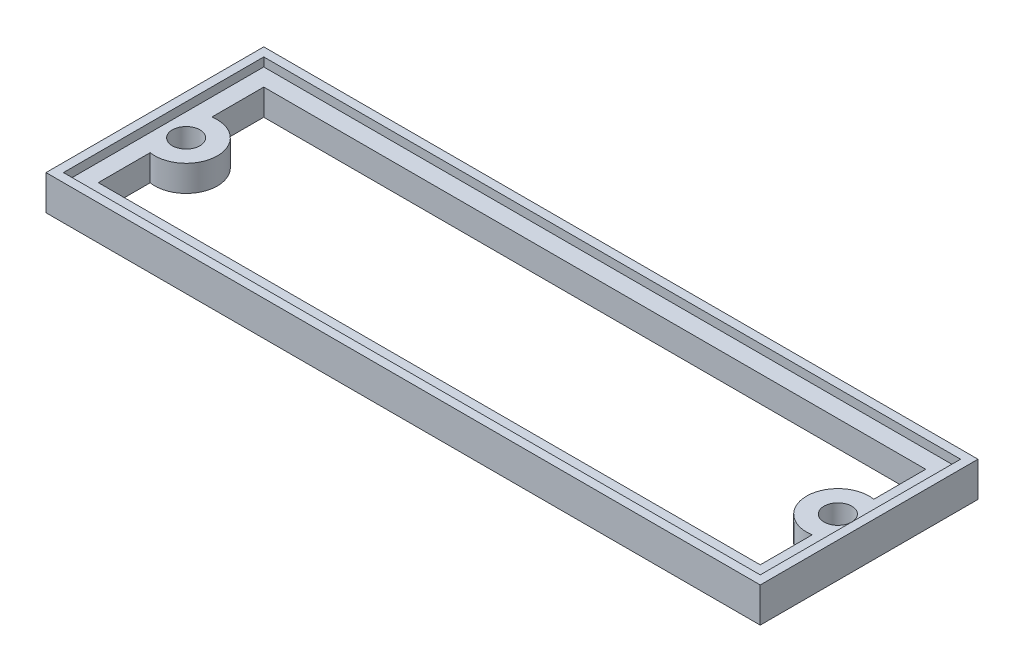
ISO-10303-21;
HEADER;
FILE_DESCRIPTION(('STEP AP214'),'2;1');
FILE_NAME('part.step','',(''),(''),'','','');
FILE_SCHEMA(('AUTOMOTIVE_DESIGN { 1 0 10303 214 1 1 1 1 }'));
ENDSEC;
DATA;
#1=APPLICATION_CONTEXT('core data for automotive mechanical design processes');
#2=APPLICATION_PROTOCOL_DEFINITION('international standard','automotive_design',2000,#1);
#3=PRODUCT_CONTEXT('',#1,'mechanical');
#4=PRODUCT('Part','Part','',(#3));
#5=PRODUCT_RELATED_PRODUCT_CATEGORY('part','',(#4));
#6=PRODUCT_DEFINITION_FORMATION('','',#4);
#7=PRODUCT_DEFINITION_CONTEXT('part definition',#1,'design');
#8=PRODUCT_DEFINITION('design','',#6,#7);
#9=PRODUCT_DEFINITION_SHAPE('','',#8);
#10=(LENGTH_UNIT() NAMED_UNIT(*) SI_UNIT(.MILLI.,.METRE.));
#11=(NAMED_UNIT(*) PLANE_ANGLE_UNIT() SI_UNIT($,.RADIAN.));
#12=(NAMED_UNIT(*) SI_UNIT($,.STERADIAN.) SOLID_ANGLE_UNIT());
#13=UNCERTAINTY_MEASURE_WITH_UNIT(LENGTH_MEASURE(1.E-05),#10,'distance_accuracy_value','');
#14=(GEOMETRIC_REPRESENTATION_CONTEXT(3) GLOBAL_UNCERTAINTY_ASSIGNED_CONTEXT((#13)) GLOBAL_UNIT_ASSIGNED_CONTEXT((#10,
#11,#12)) REPRESENTATION_CONTEXT('',''));
#15=CARTESIAN_POINT('',(0.,0.,0.));
#16=DIRECTION('',(0.,0.,1.));
#17=DIRECTION('',(1.,0.,0.));
#18=AXIS2_PLACEMENT_3D('',#15,#16,#17);
#19=CARTESIAN_POINT('',(2.58750000000001,3.,-11.5));
#20=DIRECTION('',(0.,-1.,0.));
#21=DIRECTION('',(0.,0.,-1.));
#22=AXIS2_PLACEMENT_3D('',#19,#20,#21);
#23=CYLINDRICAL_SURFACE('',#22,3.58750000000001);
#24=CARTESIAN_POINT('',(2.58750000000001,0.,-11.5));
#25=DIRECTION('',(0.,1.,0.));
#26=DIRECTION('',(0.,0.,1.));
#27=AXIS2_PLACEMENT_3D('',#24,#25,#26);
#28=CIRCLE('',#27,3.58750000000001);
#29=CARTESIAN_POINT('',(2.,0.,-15.0390676738373));
#30=VERTEX_POINT('',#29);
#31=CARTESIAN_POINT('',(2.,0.,-7.96093232616271));
#32=VERTEX_POINT('',#31);
#33=EDGE_CURVE('E167',#30,#32,#28,.F.);
#34=ORIENTED_EDGE('',*,*,#33,.F.);
#35=DIRECTION('',(0.,-1.,0.));
#36=VECTOR('',#35,1.);
#37=CARTESIAN_POINT('',(2.,3.,-15.0390676738373));
#38=LINE('',#37,#36);
#39=CARTESIAN_POINT('',(2.,3.,-15.0390676738373));
#40=VERTEX_POINT('',#39);
#41=EDGE_CURVE('E11',#40,#30,#38,.T.);
#42=ORIENTED_EDGE('',*,*,#41,.F.);
#43=CARTESIAN_POINT('',(2.58750000000001,3.,-11.5));
#44=DIRECTION('',(0.,1.,0.));
#45=DIRECTION('',(0.,0.,1.));
#46=AXIS2_PLACEMENT_3D('',#43,#44,#45);
#47=CIRCLE('',#46,3.58750000000001);
#48=CARTESIAN_POINT('',(2.,3.,-7.96093232616271));
#49=VERTEX_POINT('',#48);
#50=EDGE_CURVE('E195',#40,#49,#47,.F.);
#51=ORIENTED_EDGE('',*,*,#50,.T.);
#52=DIRECTION('',(0.,-1.,0.));
#53=VECTOR('',#52,1.);
#54=CARTESIAN_POINT('',(2.,3.,-7.96093232616271));
#55=LINE('',#54,#53);
#56=EDGE_CURVE('E102',#49,#32,#55,.T.);
#57=ORIENTED_EDGE('',*,*,#56,.T.);
#58=EDGE_LOOP('',(#34,#42,#51,#57));
#59=FACE_BOUND('',#58,.T.);
#60=ADVANCED_FACE('F41',(#59),#23,.T.);
#61=CARTESIAN_POINT('',(2.,3.,0.));
#62=DIRECTION('',(-1.,0.,0.));
#63=DIRECTION('',(0.,0.,1.));
#64=AXIS2_PLACEMENT_3D('',#61,#62,#63);
#65=PLANE('',#64);
#66=DIRECTION('',(0.,0.,-1.));
#67=VECTOR('',#66,1.);
#68=CARTESIAN_POINT('',(2.,0.,0.));
#69=LINE('',#68,#67);
#70=CARTESIAN_POINT('',(2.,0.,-21.));
#71=VERTEX_POINT('',#70);
#72=EDGE_CURVE('E174',#30,#71,#69,.T.);
#73=ORIENTED_EDGE('',*,*,#72,.T.);
#74=DIRECTION('',(0.,-1.,0.));
#75=VECTOR('',#74,1.);
#76=CARTESIAN_POINT('',(2.,3.,-21.));
#77=LINE('',#76,#75);
#78=CARTESIAN_POINT('',(2.,3.,-21.));
#79=VERTEX_POINT('',#78);
#80=EDGE_CURVE('E50',#79,#71,#77,.T.);
#81=ORIENTED_EDGE('',*,*,#80,.F.);
#82=DIRECTION('',(0.,0.,-1.));
#83=VECTOR('',#82,1.);
#84=CARTESIAN_POINT('',(2.,3.,0.));
#85=LINE('',#84,#83);
#86=EDGE_CURVE('E198',#40,#79,#85,.T.);
#87=ORIENTED_EDGE('',*,*,#86,.F.);
#88=ORIENTED_EDGE('',*,*,#41,.T.);
#89=EDGE_LOOP('',(#73,#81,#87,#88));
#90=FACE_BOUND('',#89,.T.);
#91=ADVANCED_FACE('F298',(#90),#65,.F.);
#92=CARTESIAN_POINT('',(0.,3.,-21.));
#93=DIRECTION('',(0.,0.,-1.));
#94=DIRECTION('',(-1.,0.,0.));
#95=AXIS2_PLACEMENT_3D('',#92,#93,#94);
#96=PLANE('',#95);
#97=DIRECTION('',(1.,0.,0.));
#98=VECTOR('',#97,1.);
#99=CARTESIAN_POINT('',(0.,0.,-21.));
#100=LINE('',#99,#98);
#101=CARTESIAN_POINT('',(78.,0.,-21.));
#102=VERTEX_POINT('',#101);
#103=EDGE_CURVE('E232',#71,#102,#100,.T.);
#104=ORIENTED_EDGE('',*,*,#103,.T.);
#105=DIRECTION('',(0.,-1.,0.));
#106=VECTOR('',#105,1.);
#107=CARTESIAN_POINT('',(78.,3.,-21.));
#108=LINE('',#107,#106);
#109=CARTESIAN_POINT('',(78.,3.,-21.));
#110=VERTEX_POINT('',#109);
#111=EDGE_CURVE('E268',#110,#102,#108,.T.);
#112=ORIENTED_EDGE('',*,*,#111,.F.);
#113=DIRECTION('',(1.,0.,0.));
#114=VECTOR('',#113,1.);
#115=CARTESIAN_POINT('',(0.,3.,-21.));
#116=LINE('',#115,#114);
#117=EDGE_CURVE('E202',#79,#110,#116,.T.);
#118=ORIENTED_EDGE('',*,*,#117,.F.);
#119=ORIENTED_EDGE('',*,*,#80,.T.);
#120=EDGE_LOOP('',(#104,#112,#118,#119));
#121=FACE_BOUND('',#120,.T.);
#122=ADVANCED_FACE('F276',(#121),#96,.F.);
#123=CARTESIAN_POINT('',(78.0000000000001,3.,-1.81593648406063E-13));
#124=DIRECTION('',(1.,0.,0.));
#125=DIRECTION('',(0.,0.,-1.));
#126=AXIS2_PLACEMENT_3D('',#123,#124,#125);
#127=PLANE('',#126);
#128=DIRECTION('',(0.,0.,1.));
#129=VECTOR('',#128,1.);
#130=CARTESIAN_POINT('',(78.0000000000001,0.,-1.81593648406063E-13));
#131=LINE('',#130,#129);
#132=CARTESIAN_POINT('',(78.,0.,-15.0390676738373));
#133=VERTEX_POINT('',#132);
#134=EDGE_CURVE('E235',#102,#133,#131,.T.);
#135=ORIENTED_EDGE('',*,*,#134,.T.);
#136=DIRECTION('',(0.,-1.,0.));
#137=VECTOR('',#136,1.);
#138=CARTESIAN_POINT('',(78.,3.,-15.0390676738373));
#139=LINE('',#138,#137);
#140=CARTESIAN_POINT('',(78.,3.,-15.0390676738373));
#141=VERTEX_POINT('',#140);
#142=EDGE_CURVE('E265',#141,#133,#139,.T.);
#143=ORIENTED_EDGE('',*,*,#142,.F.);
#144=DIRECTION('',(0.,0.,1.));
#145=VECTOR('',#144,1.);
#146=CARTESIAN_POINT('',(78.0000000000001,3.,-1.81593648406063E-13));
#147=LINE('',#146,#145);
#148=EDGE_CURVE('E205',#110,#141,#147,.T.);
#149=ORIENTED_EDGE('',*,*,#148,.F.);
#150=ORIENTED_EDGE('',*,*,#111,.T.);
#151=EDGE_LOOP('',(#135,#143,#149,#150));
#152=FACE_BOUND('',#151,.T.);
#153=ADVANCED_FACE('F288',(#152),#127,.F.);
#154=CARTESIAN_POINT('',(77.4125,3.,-11.5));
#155=DIRECTION('',(0.,-1.,0.));
#156=DIRECTION('',(0.,0.,-1.));
#157=AXIS2_PLACEMENT_3D('',#154,#155,#156);
#158=CYLINDRICAL_SURFACE('',#157,3.5875);
#159=CARTESIAN_POINT('',(77.4125,0.,-11.5));
#160=DIRECTION('',(0.,1.,0.));
#161=DIRECTION('',(0.,0.,1.));
#162=AXIS2_PLACEMENT_3D('',#159,#160,#161);
#163=CIRCLE('',#162,3.5875);
#164=CARTESIAN_POINT('',(78.,0.,-7.96093232616272));
#165=VERTEX_POINT('',#164);
#166=EDGE_CURVE('E237',#133,#165,#163,.T.);
#167=ORIENTED_EDGE('',*,*,#166,.T.);
#168=DIRECTION('',(0.,-1.,0.));
#169=VECTOR('',#168,1.);
#170=CARTESIAN_POINT('',(78.,3.,-7.96093232616272));
#171=LINE('',#170,#169);
#172=CARTESIAN_POINT('',(78.,3.,-7.96093232616272));
#173=VERTEX_POINT('',#172);
#174=EDGE_CURVE('E261',#173,#165,#171,.T.);
#175=ORIENTED_EDGE('',*,*,#174,.F.);
#176=CARTESIAN_POINT('',(77.4125,3.,-11.5));
#177=DIRECTION('',(0.,1.,0.));
#178=DIRECTION('',(0.,0.,1.));
#179=AXIS2_PLACEMENT_3D('',#176,#177,#178);
#180=CIRCLE('',#179,3.5875);
#181=EDGE_CURVE('E207',#141,#173,#180,.T.);
#182=ORIENTED_EDGE('',*,*,#181,.F.);
#183=ORIENTED_EDGE('',*,*,#142,.T.);
#184=EDGE_LOOP('',(#167,#175,#182,#183));
#185=FACE_BOUND('',#184,.T.);
#186=ADVANCED_FACE('F292',(#185),#158,.T.);
#187=CARTESIAN_POINT('',(78.,3.,1.81593648406063E-13));
#188=DIRECTION('',(1.,0.,0.));
#189=DIRECTION('',(0.,0.,-1.));
#190=AXIS2_PLACEMENT_3D('',#187,#188,#189);
#191=PLANE('',#190);
#192=DIRECTION('',(0.,0.,1.));
#193=VECTOR('',#192,1.);
#194=CARTESIAN_POINT('',(78.,0.,1.81593648406063E-13));
#195=LINE('',#194,#193);
#196=CARTESIAN_POINT('',(78.,0.,-2.));
#197=VERTEX_POINT('',#196);
#198=EDGE_CURVE('E240',#165,#197,#195,.T.);
#199=ORIENTED_EDGE('',*,*,#198,.T.);
#200=DIRECTION('',(0.,-1.,0.));
#201=VECTOR('',#200,1.);
#202=CARTESIAN_POINT('',(78.,3.,-2.));
#203=LINE('',#202,#201);
#204=CARTESIAN_POINT('',(78.,3.,-2.));
#205=VERTEX_POINT('',#204);
#206=EDGE_CURVE('E258',#205,#197,#203,.T.);
#207=ORIENTED_EDGE('',*,*,#206,.F.);
#208=DIRECTION('',(0.,0.,1.));
#209=VECTOR('',#208,1.);
#210=CARTESIAN_POINT('',(78.,3.,1.81593648406063E-13));
#211=LINE('',#210,#209);
#212=EDGE_CURVE('E210',#173,#205,#211,.T.);
#213=ORIENTED_EDGE('',*,*,#212,.F.);
#214=ORIENTED_EDGE('',*,*,#174,.T.);
#215=EDGE_LOOP('',(#199,#207,#213,#214));
#216=FACE_BOUND('',#215,.T.);
#217=ADVANCED_FACE('F310',(#216),#191,.F.);
#218=CARTESIAN_POINT('',(0.,3.,-2.));
#219=DIRECTION('',(0.,0.,1.));
#220=DIRECTION('',(1.,0.,0.));
#221=AXIS2_PLACEMENT_3D('',#218,#219,#220);
#222=PLANE('',#221);
#223=DIRECTION('',(-1.,0.,0.));
#224=VECTOR('',#223,1.);
#225=CARTESIAN_POINT('',(0.,0.,-2.));
#226=LINE('',#225,#224);
#227=CARTESIAN_POINT('',(2.,0.,-2.));
#228=VERTEX_POINT('',#227);
#229=EDGE_CURVE('E91',#197,#228,#226,.T.);
#230=ORIENTED_EDGE('',*,*,#229,.T.);
#231=DIRECTION('',(0.,-1.,0.));
#232=VECTOR('',#231,1.);
#233=CARTESIAN_POINT('',(2.,3.,-2.));
#234=LINE('',#233,#232);
#235=CARTESIAN_POINT('',(2.,3.,-2.));
#236=VERTEX_POINT('',#235);
#237=EDGE_CURVE('E256',#236,#228,#234,.T.);
#238=ORIENTED_EDGE('',*,*,#237,.F.);
#239=DIRECTION('',(-1.,0.,0.));
#240=VECTOR('',#239,1.);
#241=CARTESIAN_POINT('',(0.,3.,-2.));
#242=LINE('',#241,#240);
#243=EDGE_CURVE('E213',#205,#236,#242,.T.);
#244=ORIENTED_EDGE('',*,*,#243,.F.);
#245=ORIENTED_EDGE('',*,*,#206,.T.);
#246=EDGE_LOOP('',(#230,#238,#244,#245));
#247=FACE_BOUND('',#246,.T.);
#248=ADVANCED_FACE('F313',(#247),#222,.F.);
#249=CARTESIAN_POINT('',(77.4125,3.,-11.5));
#250=DIRECTION('',(0.,-1.,0.));
#251=DIRECTION('',(0.,0.,-1.));
#252=AXIS2_PLACEMENT_3D('',#249,#250,#251);
#253=CYLINDRICAL_SURFACE('',#252,1.5875);
#254=CARTESIAN_POINT('',(77.4125,3.,-11.5));
#255=DIRECTION('',(0.,1.,0.));
#256=DIRECTION('',(0.,0.,1.));
#257=AXIS2_PLACEMENT_3D('',#254,#255,#256);
#258=CIRCLE('',#257,1.5875);
#259=CARTESIAN_POINT('',(77.4125,3.,-9.9125));
#260=VERTEX_POINT('',#259);
#261=EDGE_CURVE('E222',#260,#260,#258,.T.);
#262=ORIENTED_EDGE('',*,*,#261,.T.);
#263=EDGE_LOOP('',(#262));
#264=FACE_BOUND('',#263,.T.);
#265=CARTESIAN_POINT('',(77.4125,0.,-11.5));
#266=DIRECTION('',(0.,1.,0.));
#267=DIRECTION('',(0.,0.,1.));
#268=AXIS2_PLACEMENT_3D('',#265,#266,#267);
#269=CIRCLE('',#268,1.5875);
#270=CARTESIAN_POINT('',(77.4125,0.,-9.9125));
#271=VERTEX_POINT('',#270);
#272=EDGE_CURVE('E247',#271,#271,#269,.T.);
#273=ORIENTED_EDGE('',*,*,#272,.F.);
#274=EDGE_LOOP('',(#273));
#275=FACE_BOUND('',#274,.T.);
#276=ADVANCED_FACE('F317',(#264,#275),#253,.F.);
#277=CARTESIAN_POINT('',(2.,3.,0.));
#278=DIRECTION('',(-1.,0.,0.));
#279=DIRECTION('',(0.,0.,1.));
#280=AXIS2_PLACEMENT_3D('',#277,#278,#279);
#281=PLANE('',#280);
#282=DIRECTION('',(0.,0.,-1.));
#283=VECTOR('',#282,1.);
#284=CARTESIAN_POINT('',(2.,0.,0.));
#285=LINE('',#284,#283);
#286=EDGE_CURVE('E244',#228,#32,#285,.T.);
#287=ORIENTED_EDGE('',*,*,#286,.T.);
#288=ORIENTED_EDGE('',*,*,#56,.F.);
#289=DIRECTION('',(0.,0.,-1.));
#290=VECTOR('',#289,1.);
#291=CARTESIAN_POINT('',(2.,3.,0.));
#292=LINE('',#291,#290);
#293=EDGE_CURVE('E147',#236,#49,#292,.T.);
#294=ORIENTED_EDGE('',*,*,#293,.F.);
#295=ORIENTED_EDGE('',*,*,#237,.T.);
#296=EDGE_LOOP('',(#287,#288,#294,#295));
#297=FACE_BOUND('',#296,.T.);
#298=ADVANCED_FACE('F318',(#297),#281,.F.);
#299=CARTESIAN_POINT('',(2.58750000000001,3.,-11.5));
#300=DIRECTION('',(0.,-1.,0.));
#301=DIRECTION('',(0.,0.,-1.));
#302=AXIS2_PLACEMENT_3D('',#299,#300,#301);
#303=CYLINDRICAL_SURFACE('',#302,1.5875);
#304=CARTESIAN_POINT('',(2.58750000000001,3.,-11.5));
#305=DIRECTION('',(0.,1.,0.));
#306=DIRECTION('',(0.,0.,1.));
#307=AXIS2_PLACEMENT_3D('',#304,#305,#306);
#308=CIRCLE('',#307,1.5875);
#309=CARTESIAN_POINT('',(2.58750000000001,3.,-9.91249999999999));
#310=VERTEX_POINT('',#309);
#311=EDGE_CURVE('E226',#310,#310,#308,.F.);
#312=ORIENTED_EDGE('',*,*,#311,.F.);
#313=EDGE_LOOP('',(#312));
#314=FACE_BOUND('',#313,.T.);
#315=CARTESIAN_POINT('',(2.58750000000001,0.,-11.5));
#316=DIRECTION('',(0.,1.,0.));
#317=DIRECTION('',(0.,0.,1.));
#318=AXIS2_PLACEMENT_3D('',#315,#316,#317);
#319=CIRCLE('',#318,1.5875);
#320=CARTESIAN_POINT('',(2.58750000000001,0.,-9.91249999999999));
#321=VERTEX_POINT('',#320);
#322=EDGE_CURVE('E199',#321,#321,#319,.F.);
#323=ORIENTED_EDGE('',*,*,#322,.T.);
#324=EDGE_LOOP('',(#323));
#325=FACE_BOUND('',#324,.T.);
#326=ADVANCED_FACE('F321',(#314,#325),#303,.F.);
#327=CARTESIAN_POINT('',(0.,3.,0.));
#328=DIRECTION('',(0.,1.,0.));
#329=DIRECTION('',(0.,0.,1.));
#330=AXIS2_PLACEMENT_3D('',#327,#328,#329);
#331=PLANE('',#330);
#332=ORIENTED_EDGE('',*,*,#50,.F.);
#333=ORIENTED_EDGE('',*,*,#86,.T.);
#334=ORIENTED_EDGE('',*,*,#117,.T.);
#335=ORIENTED_EDGE('',*,*,#148,.T.);
#336=ORIENTED_EDGE('',*,*,#181,.T.);
#337=ORIENTED_EDGE('',*,*,#212,.T.);
#338=ORIENTED_EDGE('',*,*,#243,.T.);
#339=ORIENTED_EDGE('',*,*,#293,.T.);
#340=EDGE_LOOP('',(#332,#333,#334,#335,#336,#337,#338,#339));
#341=FACE_BOUND('',#340,.T.);
#342=DIRECTION('',(-1.,0.,0.));
#343=VECTOR('',#342,1.);
#344=CARTESIAN_POINT('',(0.,3.,0.));
#345=LINE('',#344,#343);
#346=CARTESIAN_POINT('',(80.,3.,0.));
#347=VERTEX_POINT('',#346);
#348=CARTESIAN_POINT('',(0.,3.,0.));
#349=VERTEX_POINT('',#348);
#350=EDGE_CURVE('E136',#347,#349,#345,.T.);
#351=ORIENTED_EDGE('',*,*,#350,.F.);
#352=DIRECTION('',(0.,0.,1.));
#353=VECTOR('',#352,1.);
#354=CARTESIAN_POINT('',(80.,3.,0.));
#355=LINE('',#354,#353);
#356=CARTESIAN_POINT('',(80.,3.,-23.));
#357=VERTEX_POINT('',#356);
#358=EDGE_CURVE('E140',#357,#347,#355,.T.);
#359=ORIENTED_EDGE('',*,*,#358,.F.);
#360=DIRECTION('',(1.,0.,0.));
#361=VECTOR('',#360,1.);
#362=CARTESIAN_POINT('',(0.,3.,-23.));
#363=LINE('',#362,#361);
#364=CARTESIAN_POINT('',(0.,3.,-23.));
#365=VERTEX_POINT('',#364);
#366=EDGE_CURVE('E159',#365,#357,#363,.T.);
#367=ORIENTED_EDGE('',*,*,#366,.F.);
#368=DIRECTION('',(0.,0.,-1.));
#369=VECTOR('',#368,1.);
#370=CARTESIAN_POINT('',(0.,3.,0.));
#371=LINE('',#370,#369);
#372=EDGE_CURVE('E58',#349,#365,#371,.T.);
#373=ORIENTED_EDGE('',*,*,#372,.F.);
#374=EDGE_LOOP('',(#351,#359,#367,#373));
#375=FACE_BOUND('',#374,.T.);
#376=ORIENTED_EDGE('',*,*,#261,.F.);
#377=EDGE_LOOP('',(#376));
#378=FACE_BOUND('',#377,.T.);
#379=ORIENTED_EDGE('',*,*,#311,.T.);
#380=EDGE_LOOP('',(#379));
#381=FACE_BOUND('',#380,.T.);
#382=ADVANCED_FACE('F138',(#341,#375,#378,#381),#331,.T.);
#383=CARTESIAN_POINT('',(0.,0.,0.));
#384=DIRECTION('',(0.,1.,0.));
#385=DIRECTION('',(0.,0.,1.));
#386=AXIS2_PLACEMENT_3D('',#383,#384,#385);
#387=PLANE('',#386);
#388=ORIENTED_EDGE('',*,*,#33,.T.);
#389=ORIENTED_EDGE('',*,*,#286,.F.);
#390=ORIENTED_EDGE('',*,*,#229,.F.);
#391=ORIENTED_EDGE('',*,*,#198,.F.);
#392=ORIENTED_EDGE('',*,*,#166,.F.);
#393=ORIENTED_EDGE('',*,*,#134,.F.);
#394=ORIENTED_EDGE('',*,*,#103,.F.);
#395=ORIENTED_EDGE('',*,*,#72,.F.);
#396=EDGE_LOOP('',(#388,#389,#390,#391,#392,#393,#394,#395));
#397=FACE_BOUND('',#396,.T.);
#398=ORIENTED_EDGE('',*,*,#272,.T.);
#399=EDGE_LOOP('',(#398));
#400=FACE_BOUND('',#399,.T.);
#401=ORIENTED_EDGE('',*,*,#322,.F.);
#402=EDGE_LOOP('',(#401));
#403=FACE_BOUND('',#402,.T.);
#404=DIRECTION('',(0.,0.,-1.));
#405=VECTOR('',#404,1.);
#406=CARTESIAN_POINT('',(-1.,0.,0.));
#407=LINE('',#406,#405);
#408=CARTESIAN_POINT('',(-1.,0.,1.));
#409=VERTEX_POINT('',#408);
#410=CARTESIAN_POINT('',(-1.00000000000001,0.,-24.));
#411=VERTEX_POINT('',#410);
#412=EDGE_CURVE('E398',#409,#411,#407,.T.);
#413=ORIENTED_EDGE('',*,*,#412,.T.);
#414=DIRECTION('',(1.,0.,0.));
#415=VECTOR('',#414,1.);
#416=CARTESIAN_POINT('',(0.,0.,-24.));
#417=LINE('',#416,#415);
#418=CARTESIAN_POINT('',(81.,0.,-24.));
#419=VERTEX_POINT('',#418);
#420=EDGE_CURVE('E409',#411,#419,#417,.T.);
#421=ORIENTED_EDGE('',*,*,#420,.T.);
#422=DIRECTION('',(0.,0.,1.));
#423=VECTOR('',#422,1.);
#424=CARTESIAN_POINT('',(81.,0.,0.));
#425=LINE('',#424,#423);
#426=CARTESIAN_POINT('',(81.,0.,0.999999999999991));
#427=VERTEX_POINT('',#426);
#428=EDGE_CURVE('E406',#419,#427,#425,.T.);
#429=ORIENTED_EDGE('',*,*,#428,.T.);
#430=DIRECTION('',(-1.,0.,0.));
#431=VECTOR('',#430,1.);
#432=CARTESIAN_POINT('',(0.,0.,1.));
#433=LINE('',#432,#431);
#434=EDGE_CURVE('E402',#427,#409,#433,.T.);
#435=ORIENTED_EDGE('',*,*,#434,.T.);
#436=EDGE_LOOP('',(#413,#421,#429,#435));
#437=FACE_BOUND('',#436,.T.);
#438=ADVANCED_FACE('F282',(#397,#400,#403,#437),#387,.F.);
#439=CARTESIAN_POINT('',(80.,4.,0.));
#440=DIRECTION('',(1.,0.,0.));
#441=DIRECTION('',(0.,0.,-1.));
#442=AXIS2_PLACEMENT_3D('',#439,#440,#441);
#443=PLANE('',#442);
#444=ORIENTED_EDGE('',*,*,#358,.T.);
#445=DIRECTION('',(0.,-1.,0.));
#446=VECTOR('',#445,1.);
#447=CARTESIAN_POINT('',(80.,4.,0.));
#448=LINE('',#447,#446);
#449=CARTESIAN_POINT('',(80.,4.,0.));
#450=VERTEX_POINT('',#449);
#451=EDGE_CURVE('E155',#450,#347,#448,.T.);
#452=ORIENTED_EDGE('',*,*,#451,.F.);
#453=DIRECTION('',(0.,0.,1.));
#454=VECTOR('',#453,1.);
#455=CARTESIAN_POINT('',(80.,4.,0.));
#456=LINE('',#455,#454);
#457=CARTESIAN_POINT('',(80.,4.,-23.));
#458=VERTEX_POINT('',#457);
#459=EDGE_CURVE('E375',#458,#450,#456,.T.);
#460=ORIENTED_EDGE('',*,*,#459,.F.);
#461=DIRECTION('',(0.,-1.,0.));
#462=VECTOR('',#461,1.);
#463=CARTESIAN_POINT('',(80.,4.,-23.));
#464=LINE('',#463,#462);
#465=EDGE_CURVE('E157',#458,#357,#464,.T.);
#466=ORIENTED_EDGE('',*,*,#465,.T.);
#467=EDGE_LOOP('',(#444,#452,#460,#466));
#468=FACE_BOUND('',#467,.T.);
#469=ADVANCED_FACE('F152',(#468),#443,.F.);
#470=CARTESIAN_POINT('',(0.,4.,0.));
#471=DIRECTION('',(0.,0.,1.));
#472=DIRECTION('',(1.,0.,0.));
#473=AXIS2_PLACEMENT_3D('',#470,#471,#472);
#474=PLANE('',#473);
#475=ORIENTED_EDGE('',*,*,#350,.T.);
#476=DIRECTION('',(0.,-1.,0.));
#477=VECTOR('',#476,1.);
#478=CARTESIAN_POINT('',(0.,4.,0.));
#479=LINE('',#478,#477);
#480=CARTESIAN_POINT('',(0.,4.,0.));
#481=VERTEX_POINT('',#480);
#482=EDGE_CURVE('E168',#481,#349,#479,.T.);
#483=ORIENTED_EDGE('',*,*,#482,.F.);
#484=DIRECTION('',(-1.,0.,0.));
#485=VECTOR('',#484,1.);
#486=CARTESIAN_POINT('',(0.,4.,0.));
#487=LINE('',#486,#485);
#488=EDGE_CURVE('E164',#450,#481,#487,.T.);
#489=ORIENTED_EDGE('',*,*,#488,.F.);
#490=ORIENTED_EDGE('',*,*,#451,.T.);
#491=EDGE_LOOP('',(#475,#483,#489,#490));
#492=FACE_BOUND('',#491,.T.);
#493=ADVANCED_FACE('F162',(#492),#474,.F.);
#494=CARTESIAN_POINT('',(0.,4.,0.));
#495=DIRECTION('',(-1.,0.,0.));
#496=DIRECTION('',(0.,0.,1.));
#497=AXIS2_PLACEMENT_3D('',#494,#495,#496);
#498=PLANE('',#497);
#499=ORIENTED_EDGE('',*,*,#372,.T.);
#500=DIRECTION('',(0.,-1.,0.));
#501=VECTOR('',#500,1.);
#502=CARTESIAN_POINT('',(0.,4.,-23.));
#503=LINE('',#502,#501);
#504=CARTESIAN_POINT('',(0.,4.,-23.));
#505=VERTEX_POINT('',#504);
#506=EDGE_CURVE('E176',#505,#365,#503,.T.);
#507=ORIENTED_EDGE('',*,*,#506,.F.);
#508=DIRECTION('',(0.,0.,-1.));
#509=VECTOR('',#508,1.);
#510=CARTESIAN_POINT('',(0.,4.,0.));
#511=LINE('',#510,#509);
#512=EDGE_CURVE('E386',#481,#505,#511,.T.);
#513=ORIENTED_EDGE('',*,*,#512,.F.);
#514=ORIENTED_EDGE('',*,*,#482,.T.);
#515=EDGE_LOOP('',(#499,#507,#513,#514));
#516=FACE_BOUND('',#515,.T.);
#517=ADVANCED_FACE('F337',(#516),#498,.F.);
#518=CARTESIAN_POINT('',(-1.,4.,0.));
#519=DIRECTION('',(-1.,0.,0.));
#520=DIRECTION('',(0.,0.,1.));
#521=AXIS2_PLACEMENT_3D('',#518,#519,#520);
#522=PLANE('',#521);
#523=ORIENTED_EDGE('',*,*,#412,.F.);
#524=DIRECTION('',(0.,-1.,0.));
#525=VECTOR('',#524,1.);
#526=CARTESIAN_POINT('',(-1.,4.,1.));
#527=LINE('',#526,#525);
#528=CARTESIAN_POINT('',(-1.,4.,1.));
#529=VERTEX_POINT('',#528);
#530=EDGE_CURVE('E192',#529,#409,#527,.T.);
#531=ORIENTED_EDGE('',*,*,#530,.F.);
#532=DIRECTION('',(0.,0.,-1.));
#533=VECTOR('',#532,1.);
#534=CARTESIAN_POINT('',(-1.,4.,0.));
#535=LINE('',#534,#533);
#536=CARTESIAN_POINT('',(-1.00000000000001,4.,-24.));
#537=VERTEX_POINT('',#536);
#538=EDGE_CURVE('E372',#529,#537,#535,.T.);
#539=ORIENTED_EDGE('',*,*,#538,.T.);
#540=DIRECTION('',(0.,-1.,0.));
#541=VECTOR('',#540,1.);
#542=CARTESIAN_POINT('',(-1.00000000000001,4.,-24.));
#543=LINE('',#542,#541);
#544=EDGE_CURVE('E180',#537,#411,#543,.T.);
#545=ORIENTED_EDGE('',*,*,#544,.T.);
#546=EDGE_LOOP('',(#523,#531,#539,#545));
#547=FACE_BOUND('',#546,.T.);
#548=ADVANCED_FACE('F333',(#547),#522,.T.);
#549=CARTESIAN_POINT('',(0.,4.,1.));
#550=DIRECTION('',(0.,0.,1.));
#551=DIRECTION('',(1.,0.,0.));
#552=AXIS2_PLACEMENT_3D('',#549,#550,#551);
#553=PLANE('',#552);
#554=ORIENTED_EDGE('',*,*,#434,.F.);
#555=DIRECTION('',(0.,-1.,0.));
#556=VECTOR('',#555,1.);
#557=CARTESIAN_POINT('',(81.,4.,0.999999999999991));
#558=LINE('',#557,#556);
#559=CARTESIAN_POINT('',(81.,4.,0.999999999999991));
#560=VERTEX_POINT('',#559);
#561=EDGE_CURVE('E188',#560,#427,#558,.T.);
#562=ORIENTED_EDGE('',*,*,#561,.F.);
#563=DIRECTION('',(-1.,0.,0.));
#564=VECTOR('',#563,1.);
#565=CARTESIAN_POINT('',(0.,4.,1.));
#566=LINE('',#565,#564);
#567=EDGE_CURVE('E443',#560,#529,#566,.T.);
#568=ORIENTED_EDGE('',*,*,#567,.T.);
#569=ORIENTED_EDGE('',*,*,#530,.T.);
#570=EDGE_LOOP('',(#554,#562,#568,#569));
#571=FACE_BOUND('',#570,.T.);
#572=ADVANCED_FACE('F336',(#571),#553,.T.);
#573=CARTESIAN_POINT('',(81.,4.,0.));
#574=DIRECTION('',(1.,0.,0.));
#575=DIRECTION('',(0.,0.,-1.));
#576=AXIS2_PLACEMENT_3D('',#573,#574,#575);
#577=PLANE('',#576);
#578=ORIENTED_EDGE('',*,*,#428,.F.);
#579=DIRECTION('',(0.,-1.,0.));
#580=VECTOR('',#579,1.);
#581=CARTESIAN_POINT('',(81.,4.,-24.));
#582=LINE('',#581,#580);
#583=CARTESIAN_POINT('',(81.,4.,-24.));
#584=VERTEX_POINT('',#583);
#585=EDGE_CURVE('E184',#584,#419,#582,.T.);
#586=ORIENTED_EDGE('',*,*,#585,.F.);
#587=DIRECTION('',(0.,0.,1.));
#588=VECTOR('',#587,1.);
#589=CARTESIAN_POINT('',(81.,4.,0.));
#590=LINE('',#589,#588);
#591=EDGE_CURVE('E390',#584,#560,#590,.T.);
#592=ORIENTED_EDGE('',*,*,#591,.T.);
#593=ORIENTED_EDGE('',*,*,#561,.T.);
#594=EDGE_LOOP('',(#578,#586,#592,#593));
#595=FACE_BOUND('',#594,.T.);
#596=ADVANCED_FACE('F341',(#595),#577,.T.);
#597=CARTESIAN_POINT('',(0.,4.,-24.));
#598=DIRECTION('',(0.,0.,-1.));
#599=DIRECTION('',(-1.,0.,0.));
#600=AXIS2_PLACEMENT_3D('',#597,#598,#599);
#601=PLANE('',#600);
#602=ORIENTED_EDGE('',*,*,#420,.F.);
#603=ORIENTED_EDGE('',*,*,#544,.F.);
#604=DIRECTION('',(1.,0.,0.));
#605=VECTOR('',#604,1.);
#606=CARTESIAN_POINT('',(0.,4.,-24.));
#607=LINE('',#606,#605);
#608=EDGE_CURVE('E383',#537,#584,#607,.T.);
#609=ORIENTED_EDGE('',*,*,#608,.T.);
#610=ORIENTED_EDGE('',*,*,#585,.T.);
#611=EDGE_LOOP('',(#602,#603,#609,#610));
#612=FACE_BOUND('',#611,.T.);
#613=ADVANCED_FACE('F345',(#612),#601,.T.);
#614=CARTESIAN_POINT('',(0.,4.,-23.));
#615=DIRECTION('',(0.,0.,-1.));
#616=DIRECTION('',(-1.,0.,0.));
#617=AXIS2_PLACEMENT_3D('',#614,#615,#616);
#618=PLANE('',#617);
#619=ORIENTED_EDGE('',*,*,#366,.T.);
#620=ORIENTED_EDGE('',*,*,#465,.F.);
#621=DIRECTION('',(1.,0.,0.));
#622=VECTOR('',#621,1.);
#623=CARTESIAN_POINT('',(0.,4.,-23.));
#624=LINE('',#623,#622);
#625=EDGE_CURVE('E185',#505,#458,#624,.T.);
#626=ORIENTED_EDGE('',*,*,#625,.F.);
#627=ORIENTED_EDGE('',*,*,#506,.T.);
#628=EDGE_LOOP('',(#619,#620,#626,#627));
#629=FACE_BOUND('',#628,.T.);
#630=ADVANCED_FACE('F349',(#629),#618,.F.);
#631=CARTESIAN_POINT('',(0.,4.,0.));
#632=DIRECTION('',(0.,1.,0.));
#633=DIRECTION('',(0.,0.,1.));
#634=AXIS2_PLACEMENT_3D('',#631,#632,#633);
#635=PLANE('',#634);
#636=ORIENTED_EDGE('',*,*,#538,.F.);
#637=ORIENTED_EDGE('',*,*,#567,.F.);
#638=ORIENTED_EDGE('',*,*,#591,.F.);
#639=ORIENTED_EDGE('',*,*,#608,.F.);
#640=EDGE_LOOP('',(#636,#637,#638,#639));
#641=FACE_BOUND('',#640,.T.);
#642=ORIENTED_EDGE('',*,*,#459,.T.);
#643=ORIENTED_EDGE('',*,*,#488,.T.);
#644=ORIENTED_EDGE('',*,*,#512,.T.);
#645=ORIENTED_EDGE('',*,*,#625,.T.);
#646=EDGE_LOOP('',(#642,#643,#644,#645));
#647=FACE_BOUND('',#646,.T.);
#648=ADVANCED_FACE('F360',(#641,#647),#635,.T.);
#649=CLOSED_SHELL('',(#60,#91,#122,#153,#186,#217,#248,#276,#298,#326,#382,#438,#469,#493,#517,
#548,#572,#596,#613,#630,#648));
#650=MANIFOLD_SOLID_BREP('B2',#649);
#651=ADVANCED_BREP_SHAPE_REPRESENTATION('',(#18,#650),#14);
#652=SHAPE_DEFINITION_REPRESENTATION(#9,#651);
ENDSEC;
END-ISO-10303-21;
